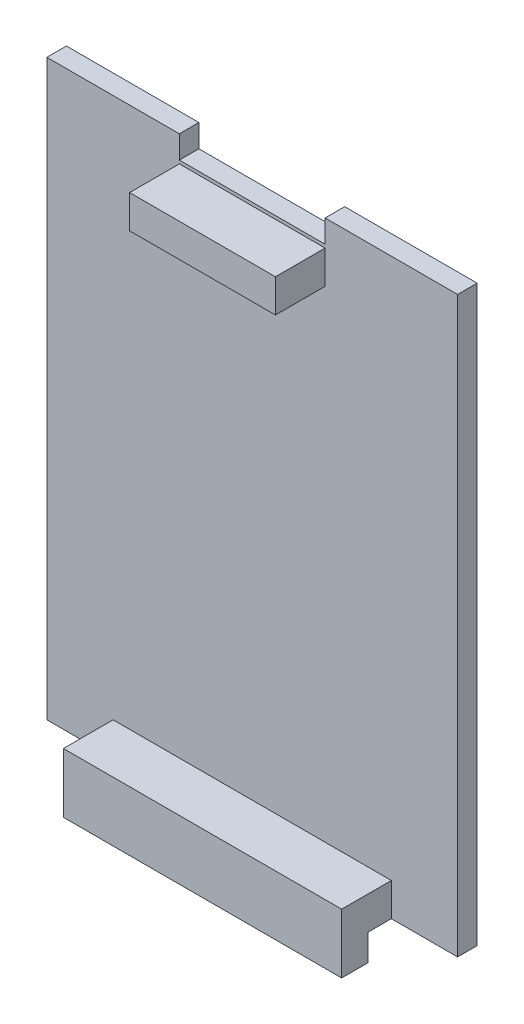
ISO-10303-21;
HEADER;
FILE_DESCRIPTION(('STEP AP214'),'2;1');
FILE_NAME('part.step','',(''),(''),'','','');
FILE_SCHEMA(('AUTOMOTIVE_DESIGN { 1 0 10303 214 1 1 1 1 }'));
ENDSEC;
DATA;
#1=APPLICATION_CONTEXT('core data for automotive mechanical design processes');
#2=APPLICATION_PROTOCOL_DEFINITION('international standard','automotive_design',2000,#1);
#3=PRODUCT_CONTEXT('',#1,'mechanical');
#4=PRODUCT('Part','Part','',(#3));
#5=PRODUCT_RELATED_PRODUCT_CATEGORY('part','',(#4));
#6=PRODUCT_DEFINITION_FORMATION('','',#4);
#7=PRODUCT_DEFINITION_CONTEXT('part definition',#1,'design');
#8=PRODUCT_DEFINITION('design','',#6,#7);
#9=PRODUCT_DEFINITION_SHAPE('','',#8);
#10=(LENGTH_UNIT() NAMED_UNIT(*) SI_UNIT(.MILLI.,.METRE.));
#11=(NAMED_UNIT(*) PLANE_ANGLE_UNIT() SI_UNIT($,.RADIAN.));
#12=(NAMED_UNIT(*) SI_UNIT($,.STERADIAN.) SOLID_ANGLE_UNIT());
#13=UNCERTAINTY_MEASURE_WITH_UNIT(LENGTH_MEASURE(1.E-05),#10,'distance_accuracy_value','');
#14=(GEOMETRIC_REPRESENTATION_CONTEXT(3) GLOBAL_UNCERTAINTY_ASSIGNED_CONTEXT((#13)) GLOBAL_UNIT_ASSIGNED_CONTEXT((#10,
#11,#12)) REPRESENTATION_CONTEXT('',''));
#15=CARTESIAN_POINT('',(0.,0.,0.));
#16=DIRECTION('',(0.,0.,1.));
#17=DIRECTION('',(1.,0.,0.));
#18=AXIS2_PLACEMENT_3D('',#15,#16,#17);
#19=CARTESIAN_POINT('',(-2.70392249772946,0.,1.5));
#20=DIRECTION('',(0.,1.,0.));
#21=DIRECTION('',(0.,0.,1.));
#22=AXIS2_PLACEMENT_3D('',#19,#20,#21);
#23=PLANE('',#22);
#24=DIRECTION('',(1.,0.,0.));
#25=VECTOR('',#24,1.);
#26=CARTESIAN_POINT('',(2.37607750227054,0.,3.278));
#27=LINE('',#26,#25);
#28=CARTESIAN_POINT('',(2.37607750227054,0.,3.278));
#29=VERTEX_POINT('',#28);
#30=CARTESIAN_POINT('',(23.7160775022705,0.,3.278));
#31=VERTEX_POINT('',#30);
#32=EDGE_CURVE('E55',#29,#31,#27,.T.);
#33=ORIENTED_EDGE('',*,*,#32,.F.);
#34=DIRECTION('',(0.,0.,-1.));
#35=VECTOR('',#34,1.);
#36=CARTESIAN_POINT('',(2.37607750227054,0.,5.31));
#37=LINE('',#36,#35);
#38=CARTESIAN_POINT('',(2.37607750227053,0.,1.5));
#39=VERTEX_POINT('',#38);
#40=EDGE_CURVE('E191',#29,#39,#37,.T.);
#41=ORIENTED_EDGE('',*,*,#40,.T.);
#42=DIRECTION('',(1.,0.,0.));
#43=VECTOR('',#42,1.);
#44=CARTESIAN_POINT('',(-2.70392249772946,0.,1.5));
#45=LINE('',#44,#43);
#46=CARTESIAN_POINT('',(-2.70392249772946,0.,1.5));
#47=VERTEX_POINT('',#46);
#48=EDGE_CURVE('E300',#47,#39,#45,.T.);
#49=ORIENTED_EDGE('',*,*,#48,.F.);
#50=DIRECTION('',(0.,0.,-1.));
#51=VECTOR('',#50,1.);
#52=CARTESIAN_POINT('',(-2.70392249772946,0.,1.5));
#53=LINE('',#52,#51);
#54=CARTESIAN_POINT('',(-2.70392249772946,0.,0.));
#55=VERTEX_POINT('',#54);
#56=EDGE_CURVE('E337',#47,#55,#53,.T.);
#57=ORIENTED_EDGE('',*,*,#56,.T.);
#58=DIRECTION('',(1.,0.,0.));
#59=VECTOR('',#58,1.);
#60=CARTESIAN_POINT('',(-2.70392249772946,0.,0.));
#61=LINE('',#60,#59);
#62=CARTESIAN_POINT('',(28.7960775022705,0.,0.));
#63=VERTEX_POINT('',#62);
#64=EDGE_CURVE('E316',#55,#63,#61,.T.);
#65=ORIENTED_EDGE('',*,*,#64,.T.);
#66=DIRECTION('',(0.,0.,-1.));
#67=VECTOR('',#66,1.);
#68=CARTESIAN_POINT('',(28.7960775022705,0.,1.5));
#69=LINE('',#68,#67);
#70=CARTESIAN_POINT('',(28.7960775022705,0.,1.5));
#71=VERTEX_POINT('',#70);
#72=EDGE_CURVE('E333',#71,#63,#69,.T.);
#73=ORIENTED_EDGE('',*,*,#72,.F.);
#74=CARTESIAN_POINT('',(23.7160775022705,0.,1.5));
#75=VERTEX_POINT('',#74);
#76=EDGE_CURVE('E298',#75,#71,#45,.T.);
#77=ORIENTED_EDGE('',*,*,#76,.F.);
#78=DIRECTION('',(0.,0.,-1.));
#79=VECTOR('',#78,1.);
#80=CARTESIAN_POINT('',(23.7160775022705,0.,5.31));
#81=LINE('',#80,#79);
#82=EDGE_CURVE('E223',#31,#75,#81,.T.);
#83=ORIENTED_EDGE('',*,*,#82,.F.);
#84=EDGE_LOOP('',(#33,#41,#49,#57,#65,#73,#77,#83));
#85=FACE_BOUND('',#84,.T.);
#86=ADVANCED_FACE('F39',(#85),#23,.F.);
#87=CARTESIAN_POINT('',(0.,0.,1.5));
#88=DIRECTION('',(0.,0.,1.));
#89=DIRECTION('',(1.,0.,0.));
#90=AXIS2_PLACEMENT_3D('',#87,#88,#89);
#91=PLANE('',#90);
#92=DIRECTION('',(1.,0.,0.));
#93=VECTOR('',#92,1.);
#94=CARTESIAN_POINT('',(7.45607750227054,39.46,1.5));
#95=LINE('',#94,#93);
#96=CARTESIAN_POINT('',(7.45607750227054,39.46,1.5));
#97=VERTEX_POINT('',#96);
#98=CARTESIAN_POINT('',(18.6360775022705,39.46,1.5));
#99=VERTEX_POINT('',#98);
#100=EDGE_CURVE('E271',#97,#99,#95,.T.);
#101=ORIENTED_EDGE('',*,*,#100,.F.);
#102=DIRECTION('',(0.,-1.,0.));
#103=VECTOR('',#102,1.);
#104=CARTESIAN_POINT('',(7.45607750227054,42.,1.5));
#105=LINE('',#104,#103);
#106=CARTESIAN_POINT('',(7.45607750227054,42.,1.5));
#107=VERTEX_POINT('',#106);
#108=EDGE_CURVE('E243',#107,#97,#105,.T.);
#109=ORIENTED_EDGE('',*,*,#108,.F.);
#110=DIRECTION('',(-1.,0.,0.));
#111=VECTOR('',#110,1.);
#112=CARTESIAN_POINT('',(7.45607750227054,42.,1.5));
#113=LINE('',#112,#111);
#114=CARTESIAN_POINT('',(18.6360775022705,42.,1.5));
#115=VERTEX_POINT('',#114);
#116=EDGE_CURVE('E258',#115,#107,#113,.T.);
#117=ORIENTED_EDGE('',*,*,#116,.F.);
#118=DIRECTION('',(0.,1.,0.));
#119=VECTOR('',#118,1.);
#120=CARTESIAN_POINT('',(18.6360775022705,42.,1.5));
#121=LINE('',#120,#119);
#122=EDGE_CURVE('E274',#99,#115,#121,.T.);
#123=ORIENTED_EDGE('',*,*,#122,.F.);
#124=EDGE_LOOP('',(#101,#109,#117,#123));
#125=FACE_BOUND('',#124,.T.);
#126=ORIENTED_EDGE('',*,*,#48,.T.);
#127=DIRECTION('',(0.,-1.,0.));
#128=VECTOR('',#127,1.);
#129=CARTESIAN_POINT('',(2.37607750227053,2.53999999999999,1.5));
#130=LINE('',#129,#128);
#131=CARTESIAN_POINT('',(2.37607750227053,2.53999999999999,1.5));
#132=VERTEX_POINT('',#131);
#133=EDGE_CURVE('E193',#132,#39,#130,.T.);
#134=ORIENTED_EDGE('',*,*,#133,.F.);
#135=DIRECTION('',(-1.,0.,0.));
#136=VECTOR('',#135,1.);
#137=CARTESIAN_POINT('',(2.37607750227053,2.53999999999999,1.5));
#138=LINE('',#137,#136);
#139=CARTESIAN_POINT('',(23.7160775022705,2.54,1.5));
#140=VERTEX_POINT('',#139);
#141=EDGE_CURVE('E63',#140,#132,#138,.T.);
#142=ORIENTED_EDGE('',*,*,#141,.F.);
#143=DIRECTION('',(0.,1.,0.));
#144=VECTOR('',#143,1.);
#145=CARTESIAN_POINT('',(23.7160775022705,2.54,1.5));
#146=LINE('',#145,#144);
#147=EDGE_CURVE('E197',#75,#140,#146,.T.);
#148=ORIENTED_EDGE('',*,*,#147,.F.);
#149=ORIENTED_EDGE('',*,*,#76,.T.);
#150=DIRECTION('',(0.,1.,0.));
#151=VECTOR('',#150,1.);
#152=CARTESIAN_POINT('',(28.7960775022705,44.,1.5));
#153=LINE('',#152,#151);
#154=CARTESIAN_POINT('',(28.7960775022705,44.,1.5));
#155=VERTEX_POINT('',#154);
#156=EDGE_CURVE('E304',#71,#155,#153,.T.);
#157=ORIENTED_EDGE('',*,*,#156,.T.);
#158=DIRECTION('',(-1.,0.,0.));
#159=VECTOR('',#158,1.);
#160=CARTESIAN_POINT('',(-2.70392249772947,44.,1.5));
#161=LINE('',#160,#159);
#162=CARTESIAN_POINT('',(18.6360775022705,44.,1.5));
#163=VERTEX_POINT('',#162);
#164=EDGE_CURVE('E308',#155,#163,#161,.T.);
#165=ORIENTED_EDGE('',*,*,#164,.T.);
#166=DIRECTION('',(0.,1.,0.));
#167=VECTOR('',#166,1.);
#168=CARTESIAN_POINT('',(18.6360775022705,44.,1.5));
#169=LINE('',#168,#167);
#170=CARTESIAN_POINT('',(18.6360775022705,42.254,1.5));
#171=VERTEX_POINT('',#170);
#172=EDGE_CURVE('E236',#171,#163,#169,.T.);
#173=ORIENTED_EDGE('',*,*,#172,.F.);
#174=DIRECTION('',(1.,0.,0.));
#175=VECTOR('',#174,1.);
#176=CARTESIAN_POINT('',(7.45607750227054,42.254,1.5));
#177=LINE('',#176,#175);
#178=CARTESIAN_POINT('',(7.45607750227054,42.254,1.5));
#179=VERTEX_POINT('',#178);
#180=EDGE_CURVE('E232',#179,#171,#177,.T.);
#181=ORIENTED_EDGE('',*,*,#180,.F.);
#182=DIRECTION('',(0.,-1.,0.));
#183=VECTOR('',#182,1.);
#184=CARTESIAN_POINT('',(7.45607750227054,44.,1.5));
#185=LINE('',#184,#183);
#186=CARTESIAN_POINT('',(7.45607750227054,44.,1.5));
#187=VERTEX_POINT('',#186);
#188=EDGE_CURVE('E228',#187,#179,#185,.T.);
#189=ORIENTED_EDGE('',*,*,#188,.F.);
#190=CARTESIAN_POINT('',(-2.70392249772947,44.,1.5));
#191=VERTEX_POINT('',#190);
#192=EDGE_CURVE('E307',#187,#191,#161,.T.);
#193=ORIENTED_EDGE('',*,*,#192,.T.);
#194=DIRECTION('',(0.,-1.,0.));
#195=VECTOR('',#194,1.);
#196=CARTESIAN_POINT('',(-2.70392249772947,44.,1.5));
#197=LINE('',#196,#195);
#198=EDGE_CURVE('E294',#191,#47,#197,.T.);
#199=ORIENTED_EDGE('',*,*,#198,.T.);
#200=EDGE_LOOP('',(#126,#134,#142,#148,#149,#157,#165,#173,#181,#189,#193,#199));
#201=FACE_BOUND('',#200,.T.);
#202=ADVANCED_FACE('F374',(#125,#201),#91,.T.);
#203=CARTESIAN_POINT('',(-2.70392249772947,44.,1.5));
#204=DIRECTION('',(0.,-1.,0.));
#205=DIRECTION('',(0.,0.,-1.));
#206=AXIS2_PLACEMENT_3D('',#203,#204,#205);
#207=PLANE('',#206);
#208=ORIENTED_EDGE('',*,*,#192,.F.);
#209=DIRECTION('',(0.,0.,1.));
#210=VECTOR('',#209,1.);
#211=CARTESIAN_POINT('',(7.45607750227054,44.,-2.31));
#212=LINE('',#211,#210);
#213=CARTESIAN_POINT('',(7.45607750227054,44.,0.));
#214=VERTEX_POINT('',#213);
#215=EDGE_CURVE('E240',#214,#187,#212,.T.);
#216=ORIENTED_EDGE('',*,*,#215,.F.);
#217=DIRECTION('',(-1.,0.,0.));
#218=VECTOR('',#217,1.);
#219=CARTESIAN_POINT('',(-2.70392249772947,44.,0.));
#220=LINE('',#219,#218);
#221=CARTESIAN_POINT('',(-2.70392249772947,44.,0.));
#222=VERTEX_POINT('',#221);
#223=EDGE_CURVE('E322',#214,#222,#220,.T.);
#224=ORIENTED_EDGE('',*,*,#223,.T.);
#225=DIRECTION('',(0.,0.,-1.));
#226=VECTOR('',#225,1.);
#227=CARTESIAN_POINT('',(-2.70392249772947,44.,1.5));
#228=LINE('',#227,#226);
#229=EDGE_CURVE('E312',#191,#222,#228,.T.);
#230=ORIENTED_EDGE('',*,*,#229,.F.);
#231=EDGE_LOOP('',(#208,#216,#224,#230));
#232=FACE_BOUND('',#231,.T.);
#233=ADVANCED_FACE('F368',(#232),#207,.F.);
#234=CARTESIAN_POINT('',(-2.70392249772947,44.,1.5));
#235=DIRECTION('',(1.,0.,0.));
#236=DIRECTION('',(0.,1.,0.));
#237=AXIS2_PLACEMENT_3D('',#234,#235,#236);
#238=PLANE('',#237);
#239=DIRECTION('',(0.,-1.,0.));
#240=VECTOR('',#239,1.);
#241=CARTESIAN_POINT('',(-2.70392249772947,44.,0.));
#242=LINE('',#241,#240);
#243=EDGE_CURVE('E293',#222,#55,#242,.T.);
#244=ORIENTED_EDGE('',*,*,#243,.T.);
#245=ORIENTED_EDGE('',*,*,#56,.F.);
#246=ORIENTED_EDGE('',*,*,#198,.F.);
#247=ORIENTED_EDGE('',*,*,#229,.T.);
#248=EDGE_LOOP('',(#244,#245,#246,#247));
#249=FACE_BOUND('',#248,.T.);
#250=ADVANCED_FACE('F41',(#249),#238,.F.);
#251=CARTESIAN_POINT('',(28.7960775022705,44.,1.5));
#252=DIRECTION('',(-1.,0.,0.));
#253=DIRECTION('',(0.,0.,1.));
#254=AXIS2_PLACEMENT_3D('',#251,#252,#253);
#255=PLANE('',#254);
#256=DIRECTION('',(0.,1.,0.));
#257=VECTOR('',#256,1.);
#258=CARTESIAN_POINT('',(28.7960775022705,44.,0.));
#259=LINE('',#258,#257);
#260=CARTESIAN_POINT('',(28.7960775022705,44.,0.));
#261=VERTEX_POINT('',#260);
#262=EDGE_CURVE('E319',#63,#261,#259,.T.);
#263=ORIENTED_EDGE('',*,*,#262,.T.);
#264=DIRECTION('',(0.,0.,-1.));
#265=VECTOR('',#264,1.);
#266=CARTESIAN_POINT('',(28.7960775022705,44.,1.5));
#267=LINE('',#266,#265);
#268=EDGE_CURVE('E329',#155,#261,#267,.T.);
#269=ORIENTED_EDGE('',*,*,#268,.F.);
#270=ORIENTED_EDGE('',*,*,#156,.F.);
#271=ORIENTED_EDGE('',*,*,#72,.T.);
#272=EDGE_LOOP('',(#263,#269,#270,#271));
#273=FACE_BOUND('',#272,.T.);
#274=ADVANCED_FACE('F359',(#273),#255,.F.);
#275=CARTESIAN_POINT('',(18.6360775022705,44.,0.));
#276=VERTEX_POINT('',#275);
#277=EDGE_CURVE('E299',#261,#276,#220,.T.);
#278=ORIENTED_EDGE('',*,*,#277,.T.);
#279=DIRECTION('',(0.,0.,1.));
#280=VECTOR('',#279,1.);
#281=CARTESIAN_POINT('',(18.6360775022705,44.,-2.31));
#282=LINE('',#281,#280);
#283=EDGE_CURVE('E244',#276,#163,#282,.T.);
#284=ORIENTED_EDGE('',*,*,#283,.T.);
#285=ORIENTED_EDGE('',*,*,#164,.F.);
#286=ORIENTED_EDGE('',*,*,#268,.T.);
#287=EDGE_LOOP('',(#278,#284,#285,#286));
#288=FACE_BOUND('',#287,.T.);
#289=ADVANCED_FACE('F354',(#288),#207,.F.);
#290=CARTESIAN_POINT('',(0.,0.,0.));
#291=DIRECTION('',(0.,0.,1.));
#292=DIRECTION('',(1.,0.,0.));
#293=AXIS2_PLACEMENT_3D('',#290,#291,#292);
#294=PLANE('',#293);
#295=ORIENTED_EDGE('',*,*,#223,.F.);
#296=DIRECTION('',(0.,-1.,0.));
#297=VECTOR('',#296,1.);
#298=CARTESIAN_POINT('',(7.45607750227054,0.,0.));
#299=LINE('',#298,#297);
#300=CARTESIAN_POINT('',(7.45607750227054,42.254,0.));
#301=VERTEX_POINT('',#300);
#302=EDGE_CURVE('E11',#214,#301,#299,.T.);
#303=ORIENTED_EDGE('',*,*,#302,.T.);
#304=DIRECTION('',(1.,0.,0.));
#305=VECTOR('',#304,1.);
#306=CARTESIAN_POINT('',(0.,42.254,0.));
#307=LINE('',#306,#305);
#308=CARTESIAN_POINT('',(18.6360775022705,42.254,0.));
#309=VERTEX_POINT('',#308);
#310=EDGE_CURVE('E341',#301,#309,#307,.T.);
#311=ORIENTED_EDGE('',*,*,#310,.T.);
#312=DIRECTION('',(0.,1.,0.));
#313=VECTOR('',#312,1.);
#314=CARTESIAN_POINT('',(18.6360775022705,0.,0.));
#315=LINE('',#314,#313);
#316=EDGE_CURVE('E48',#309,#276,#315,.T.);
#317=ORIENTED_EDGE('',*,*,#316,.T.);
#318=ORIENTED_EDGE('',*,*,#277,.F.);
#319=ORIENTED_EDGE('',*,*,#262,.F.);
#320=ORIENTED_EDGE('',*,*,#64,.F.);
#321=ORIENTED_EDGE('',*,*,#243,.F.);
#322=EDGE_LOOP('',(#295,#303,#311,#317,#318,#319,#320,#321));
#323=FACE_BOUND('',#322,.T.);
#324=ADVANCED_FACE('F350',(#323),#294,.F.);
#325=CARTESIAN_POINT('',(7.45607750227054,42.,5.31));
#326=DIRECTION('',(1.,0.,0.));
#327=DIRECTION('',(0.,0.,-1.));
#328=AXIS2_PLACEMENT_3D('',#325,#326,#327);
#329=PLANE('',#328);
#330=ORIENTED_EDGE('',*,*,#108,.T.);
#331=DIRECTION('',(0.,0.,-1.));
#332=VECTOR('',#331,1.);
#333=CARTESIAN_POINT('',(7.45607750227054,39.46,5.31));
#334=LINE('',#333,#332);
#335=CARTESIAN_POINT('',(7.45607750227054,39.46,5.31));
#336=VERTEX_POINT('',#335);
#337=EDGE_CURVE('E290',#336,#97,#334,.T.);
#338=ORIENTED_EDGE('',*,*,#337,.F.);
#339=DIRECTION('',(0.,-1.,0.));
#340=VECTOR('',#339,1.);
#341=CARTESIAN_POINT('',(7.45607750227054,42.,5.31));
#342=LINE('',#341,#340);
#343=CARTESIAN_POINT('',(7.45607750227054,42.,5.31));
#344=VERTEX_POINT('',#343);
#345=EDGE_CURVE('E253',#344,#336,#342,.T.);
#346=ORIENTED_EDGE('',*,*,#345,.F.);
#347=DIRECTION('',(0.,0.,-1.));
#348=VECTOR('',#347,1.);
#349=CARTESIAN_POINT('',(7.45607750227054,42.,5.31));
#350=LINE('',#349,#348);
#351=EDGE_CURVE('E267',#344,#107,#350,.T.);
#352=ORIENTED_EDGE('',*,*,#351,.T.);
#353=EDGE_LOOP('',(#330,#338,#346,#352));
#354=FACE_BOUND('',#353,.T.);
#355=ADVANCED_FACE('F418',(#354),#329,.F.);
#356=CARTESIAN_POINT('',(7.45607750227054,39.46,5.31));
#357=DIRECTION('',(0.,1.,0.));
#358=DIRECTION('',(0.,0.,1.));
#359=AXIS2_PLACEMENT_3D('',#356,#357,#358);
#360=PLANE('',#359);
#361=ORIENTED_EDGE('',*,*,#100,.T.);
#362=DIRECTION('',(0.,0.,-1.));
#363=VECTOR('',#362,1.);
#364=CARTESIAN_POINT('',(18.6360775022705,39.46,5.31));
#365=LINE('',#364,#363);
#366=CARTESIAN_POINT('',(18.6360775022705,39.46,5.31));
#367=VERTEX_POINT('',#366);
#368=EDGE_CURVE('E286',#367,#99,#365,.T.);
#369=ORIENTED_EDGE('',*,*,#368,.F.);
#370=DIRECTION('',(1.,0.,0.));
#371=VECTOR('',#370,1.);
#372=CARTESIAN_POINT('',(7.45607750227054,39.46,5.31));
#373=LINE('',#372,#371);
#374=EDGE_CURVE('E257',#336,#367,#373,.T.);
#375=ORIENTED_EDGE('',*,*,#374,.F.);
#376=ORIENTED_EDGE('',*,*,#337,.T.);
#377=EDGE_LOOP('',(#361,#369,#375,#376));
#378=FACE_BOUND('',#377,.T.);
#379=ADVANCED_FACE('F422',(#378),#360,.F.);
#380=CARTESIAN_POINT('',(18.6360775022705,42.,5.31));
#381=DIRECTION('',(-1.,0.,0.));
#382=DIRECTION('',(0.,0.,1.));
#383=AXIS2_PLACEMENT_3D('',#380,#381,#382);
#384=PLANE('',#383);
#385=ORIENTED_EDGE('',*,*,#122,.T.);
#386=DIRECTION('',(0.,0.,-1.));
#387=VECTOR('',#386,1.);
#388=CARTESIAN_POINT('',(18.6360775022705,42.,5.31));
#389=LINE('',#388,#387);
#390=CARTESIAN_POINT('',(18.6360775022705,42.,5.31));
#391=VERTEX_POINT('',#390);
#392=EDGE_CURVE('E283',#391,#115,#389,.T.);
#393=ORIENTED_EDGE('',*,*,#392,.F.);
#394=DIRECTION('',(0.,1.,0.));
#395=VECTOR('',#394,1.);
#396=CARTESIAN_POINT('',(18.6360775022705,42.,5.31));
#397=LINE('',#396,#395);
#398=EDGE_CURVE('E261',#367,#391,#397,.T.);
#399=ORIENTED_EDGE('',*,*,#398,.F.);
#400=ORIENTED_EDGE('',*,*,#368,.T.);
#401=EDGE_LOOP('',(#385,#393,#399,#400));
#402=FACE_BOUND('',#401,.T.);
#403=ADVANCED_FACE('F426',(#402),#384,.F.);
#404=CARTESIAN_POINT('',(7.45607750227054,42.,5.31));
#405=DIRECTION('',(0.,-1.,0.));
#406=DIRECTION('',(0.,0.,-1.));
#407=AXIS2_PLACEMENT_3D('',#404,#405,#406);
#408=PLANE('',#407);
#409=ORIENTED_EDGE('',*,*,#116,.T.);
#410=ORIENTED_EDGE('',*,*,#351,.F.);
#411=DIRECTION('',(-1.,0.,0.));
#412=VECTOR('',#411,1.);
#413=CARTESIAN_POINT('',(7.45607750227054,42.,5.31));
#414=LINE('',#413,#412);
#415=EDGE_CURVE('E264',#391,#344,#414,.T.);
#416=ORIENTED_EDGE('',*,*,#415,.F.);
#417=ORIENTED_EDGE('',*,*,#392,.T.);
#418=EDGE_LOOP('',(#409,#410,#416,#417));
#419=FACE_BOUND('',#418,.T.);
#420=ADVANCED_FACE('F430',(#419),#408,.F.);
#421=CARTESIAN_POINT('',(0.,0.,5.31));
#422=DIRECTION('',(0.,0.,1.));
#423=DIRECTION('',(1.,0.,0.));
#424=AXIS2_PLACEMENT_3D('',#421,#422,#423);
#425=PLANE('',#424);
#426=ORIENTED_EDGE('',*,*,#345,.T.);
#427=ORIENTED_EDGE('',*,*,#374,.T.);
#428=ORIENTED_EDGE('',*,*,#398,.T.);
#429=ORIENTED_EDGE('',*,*,#415,.T.);
#430=EDGE_LOOP('',(#426,#427,#428,#429));
#431=FACE_BOUND('',#430,.T.);
#432=ADVANCED_FACE('F434',(#431),#425,.T.);
#433=CARTESIAN_POINT('',(7.45607750227054,44.,-2.31));
#434=DIRECTION('',(-1.,0.,0.));
#435=DIRECTION('',(0.,0.,1.));
#436=AXIS2_PLACEMENT_3D('',#433,#434,#435);
#437=PLANE('',#436);
#438=ORIENTED_EDGE('',*,*,#215,.T.);
#439=ORIENTED_EDGE('',*,*,#188,.T.);
#440=DIRECTION('',(0.,0.,1.));
#441=VECTOR('',#440,1.);
#442=CARTESIAN_POINT('',(7.45607750227054,42.254,-2.31));
#443=LINE('',#442,#441);
#444=EDGE_CURVE('E239',#301,#179,#443,.T.);
#445=ORIENTED_EDGE('',*,*,#444,.F.);
#446=ORIENTED_EDGE('',*,*,#302,.F.);
#447=EDGE_LOOP('',(#438,#439,#445,#446));
#448=FACE_BOUND('',#447,.T.);
#449=ADVANCED_FACE('F379',(#448),#437,.F.);
#450=CARTESIAN_POINT('',(18.6360775022705,44.,-2.31));
#451=DIRECTION('',(1.,0.,0.));
#452=DIRECTION('',(0.,0.,-1.));
#453=AXIS2_PLACEMENT_3D('',#450,#451,#452);
#454=PLANE('',#453);
#455=DIRECTION('',(0.,0.,1.));
#456=VECTOR('',#455,1.);
#457=CARTESIAN_POINT('',(18.6360775022705,42.254,-2.31));
#458=LINE('',#457,#456);
#459=EDGE_CURVE('E248',#309,#171,#458,.T.);
#460=ORIENTED_EDGE('',*,*,#459,.T.);
#461=ORIENTED_EDGE('',*,*,#172,.T.);
#462=ORIENTED_EDGE('',*,*,#283,.F.);
#463=ORIENTED_EDGE('',*,*,#316,.F.);
#464=EDGE_LOOP('',(#460,#461,#462,#463));
#465=FACE_BOUND('',#464,.T.);
#466=ADVANCED_FACE('F382',(#465),#454,.F.);
#467=CARTESIAN_POINT('',(7.45607750227054,42.254,-2.31));
#468=DIRECTION('',(0.,-1.,0.));
#469=DIRECTION('',(0.,0.,-1.));
#470=AXIS2_PLACEMENT_3D('',#467,#468,#469);
#471=PLANE('',#470);
#472=ORIENTED_EDGE('',*,*,#444,.T.);
#473=ORIENTED_EDGE('',*,*,#180,.T.);
#474=ORIENTED_EDGE('',*,*,#459,.F.);
#475=ORIENTED_EDGE('',*,*,#310,.F.);
#476=EDGE_LOOP('',(#472,#473,#474,#475));
#477=FACE_BOUND('',#476,.T.);
#478=ADVANCED_FACE('F381',(#477),#471,.F.);
#479=CARTESIAN_POINT('',(2.37607750227053,2.53999999999999,5.31));
#480=DIRECTION('',(1.,0.,0.));
#481=DIRECTION('',(0.,1.,0.));
#482=AXIS2_PLACEMENT_3D('',#479,#480,#481);
#483=PLANE('',#482);
#484=ORIENTED_EDGE('',*,*,#133,.T.);
#485=ORIENTED_EDGE('',*,*,#40,.F.);
#486=DIRECTION('',(0.,1.,0.));
#487=VECTOR('',#486,1.);
#488=CARTESIAN_POINT('',(2.37607750227054,-2.032,3.278));
#489=LINE('',#488,#487);
#490=CARTESIAN_POINT('',(2.37607750227054,-2.032,3.278));
#491=VERTEX_POINT('',#490);
#492=EDGE_CURVE('E170',#491,#29,#489,.T.);
#493=ORIENTED_EDGE('',*,*,#492,.F.);
#494=DIRECTION('',(0.,0.,-1.));
#495=VECTOR('',#494,1.);
#496=CARTESIAN_POINT('',(2.37607750227054,-2.032,5.31));
#497=LINE('',#496,#495);
#498=CARTESIAN_POINT('',(2.37607750227054,-2.032,5.31));
#499=VERTEX_POINT('',#498);
#500=EDGE_CURVE('E178',#499,#491,#497,.T.);
#501=ORIENTED_EDGE('',*,*,#500,.F.);
#502=DIRECTION('',(0.,-1.,0.));
#503=VECTOR('',#502,1.);
#504=CARTESIAN_POINT('',(2.37607750227053,2.53999999999999,5.31));
#505=LINE('',#504,#503);
#506=CARTESIAN_POINT('',(2.37607750227053,2.53999999999999,5.31));
#507=VERTEX_POINT('',#506);
#508=EDGE_CURVE('E202',#507,#499,#505,.T.);
#509=ORIENTED_EDGE('',*,*,#508,.F.);
#510=DIRECTION('',(0.,0.,-1.));
#511=VECTOR('',#510,1.);
#512=CARTESIAN_POINT('',(2.37607750227053,2.53999999999999,5.31));
#513=LINE('',#512,#511);
#514=EDGE_CURVE('E210',#507,#132,#513,.T.);
#515=ORIENTED_EDGE('',*,*,#514,.T.);
#516=EDGE_LOOP('',(#484,#485,#493,#501,#509,#515));
#517=FACE_BOUND('',#516,.T.);
#518=ADVANCED_FACE('F190',(#517),#483,.F.);
#519=CARTESIAN_POINT('',(23.7160775022705,2.54,5.31));
#520=DIRECTION('',(-1.,0.,0.));
#521=DIRECTION('',(0.,0.,1.));
#522=AXIS2_PLACEMENT_3D('',#519,#520,#521);
#523=PLANE('',#522);
#524=ORIENTED_EDGE('',*,*,#147,.T.);
#525=DIRECTION('',(0.,0.,-1.));
#526=VECTOR('',#525,1.);
#527=CARTESIAN_POINT('',(23.7160775022705,2.54,5.31));
#528=LINE('',#527,#526);
#529=CARTESIAN_POINT('',(23.7160775022705,2.54,5.31));
#530=VERTEX_POINT('',#529);
#531=EDGE_CURVE('E219',#530,#140,#528,.T.);
#532=ORIENTED_EDGE('',*,*,#531,.F.);
#533=DIRECTION('',(0.,1.,0.));
#534=VECTOR('',#533,1.);
#535=CARTESIAN_POINT('',(23.7160775022705,2.54,5.31));
#536=LINE('',#535,#534);
#537=CARTESIAN_POINT('',(23.7160775022705,-2.032,5.31));
#538=VERTEX_POINT('',#537);
#539=EDGE_CURVE('E205',#538,#530,#536,.T.);
#540=ORIENTED_EDGE('',*,*,#539,.F.);
#541=DIRECTION('',(0.,0.,1.));
#542=VECTOR('',#541,1.);
#543=CARTESIAN_POINT('',(23.7160775022705,-2.032,5.31));
#544=LINE('',#543,#542);
#545=CARTESIAN_POINT('',(23.7160775022705,-2.032,3.278));
#546=VERTEX_POINT('',#545);
#547=EDGE_CURVE('E177',#546,#538,#544,.T.);
#548=ORIENTED_EDGE('',*,*,#547,.F.);
#549=DIRECTION('',(0.,1.,0.));
#550=VECTOR('',#549,1.);
#551=CARTESIAN_POINT('',(23.7160775022705,-2.032,3.278));
#552=LINE('',#551,#550);
#553=EDGE_CURVE('E172',#546,#31,#552,.T.);
#554=ORIENTED_EDGE('',*,*,#553,.T.);
#555=ORIENTED_EDGE('',*,*,#82,.T.);
#556=EDGE_LOOP('',(#524,#532,#540,#548,#554,#555));
#557=FACE_BOUND('',#556,.T.);
#558=ADVANCED_FACE('F386',(#557),#523,.F.);
#559=CARTESIAN_POINT('',(2.37607750227053,2.53999999999999,5.31));
#560=DIRECTION('',(0.,-1.,0.));
#561=DIRECTION('',(1.,0.,0.));
#562=AXIS2_PLACEMENT_3D('',#559,#560,#561);
#563=PLANE('',#562);
#564=ORIENTED_EDGE('',*,*,#141,.T.);
#565=ORIENTED_EDGE('',*,*,#514,.F.);
#566=DIRECTION('',(-1.,0.,0.));
#567=VECTOR('',#566,1.);
#568=CARTESIAN_POINT('',(2.37607750227053,2.53999999999999,5.31));
#569=LINE('',#568,#567);
#570=EDGE_CURVE('E208',#530,#507,#569,.T.);
#571=ORIENTED_EDGE('',*,*,#570,.F.);
#572=ORIENTED_EDGE('',*,*,#531,.T.);
#573=EDGE_LOOP('',(#564,#565,#571,#572));
#574=FACE_BOUND('',#573,.T.);
#575=ADVANCED_FACE('F397',(#574),#563,.F.);
#576=CARTESIAN_POINT('',(0.,0.,5.31));
#577=DIRECTION('',(0.,0.,1.));
#578=DIRECTION('',(1.,0.,0.));
#579=AXIS2_PLACEMENT_3D('',#576,#577,#578);
#580=PLANE('',#579);
#581=ORIENTED_EDGE('',*,*,#508,.T.);
#582=DIRECTION('',(-1.,0.,0.));
#583=VECTOR('',#582,1.);
#584=CARTESIAN_POINT('',(2.37607750227054,-2.032,5.31));
#585=LINE('',#584,#583);
#586=EDGE_CURVE('E184',#538,#499,#585,.T.);
#587=ORIENTED_EDGE('',*,*,#586,.F.);
#588=ORIENTED_EDGE('',*,*,#539,.T.);
#589=ORIENTED_EDGE('',*,*,#570,.T.);
#590=EDGE_LOOP('',(#581,#587,#588,#589));
#591=FACE_BOUND('',#590,.T.);
#592=ADVANCED_FACE('F393',(#591),#580,.T.);
#593=CARTESIAN_POINT('',(2.37607750227054,-2.032,3.278));
#594=DIRECTION('',(0.,0.,1.));
#595=DIRECTION('',(1.,0.,0.));
#596=AXIS2_PLACEMENT_3D('',#593,#594,#595);
#597=PLANE('',#596);
#598=ORIENTED_EDGE('',*,*,#32,.T.);
#599=ORIENTED_EDGE('',*,*,#553,.F.);
#600=DIRECTION('',(1.,0.,0.));
#601=VECTOR('',#600,1.);
#602=CARTESIAN_POINT('',(2.37607750227054,-2.032,3.278));
#603=LINE('',#602,#601);
#604=EDGE_CURVE('E166',#491,#546,#603,.T.);
#605=ORIENTED_EDGE('',*,*,#604,.F.);
#606=ORIENTED_EDGE('',*,*,#492,.T.);
#607=EDGE_LOOP('',(#598,#599,#605,#606));
#608=FACE_BOUND('',#607,.T.);
#609=ADVANCED_FACE('F168',(#608),#597,.F.);
#610=CARTESIAN_POINT('',(0.,-2.032,0.));
#611=DIRECTION('',(0.,-1.,0.));
#612=DIRECTION('',(0.,0.,-1.));
#613=AXIS2_PLACEMENT_3D('',#610,#611,#612);
#614=PLANE('',#613);
#615=ORIENTED_EDGE('',*,*,#500,.T.);
#616=ORIENTED_EDGE('',*,*,#604,.T.);
#617=ORIENTED_EDGE('',*,*,#547,.T.);
#618=ORIENTED_EDGE('',*,*,#586,.T.);
#619=EDGE_LOOP('',(#615,#616,#617,#618));
#620=FACE_BOUND('',#619,.T.);
#621=ADVANCED_FACE('F182',(#620),#614,.T.);
#622=CLOSED_SHELL('',(#86,#202,#233,#250,#274,#289,#324,#355,#379,#403,#420,#432,#449,#466,#478,
#518,#558,#575,#592,#609,#621));
#623=MANIFOLD_SOLID_BREP('B2',#622);
#624=ADVANCED_BREP_SHAPE_REPRESENTATION('',(#18,#623),#14);
#625=SHAPE_DEFINITION_REPRESENTATION(#9,#624);
ENDSEC;
END-ISO-10303-21;
